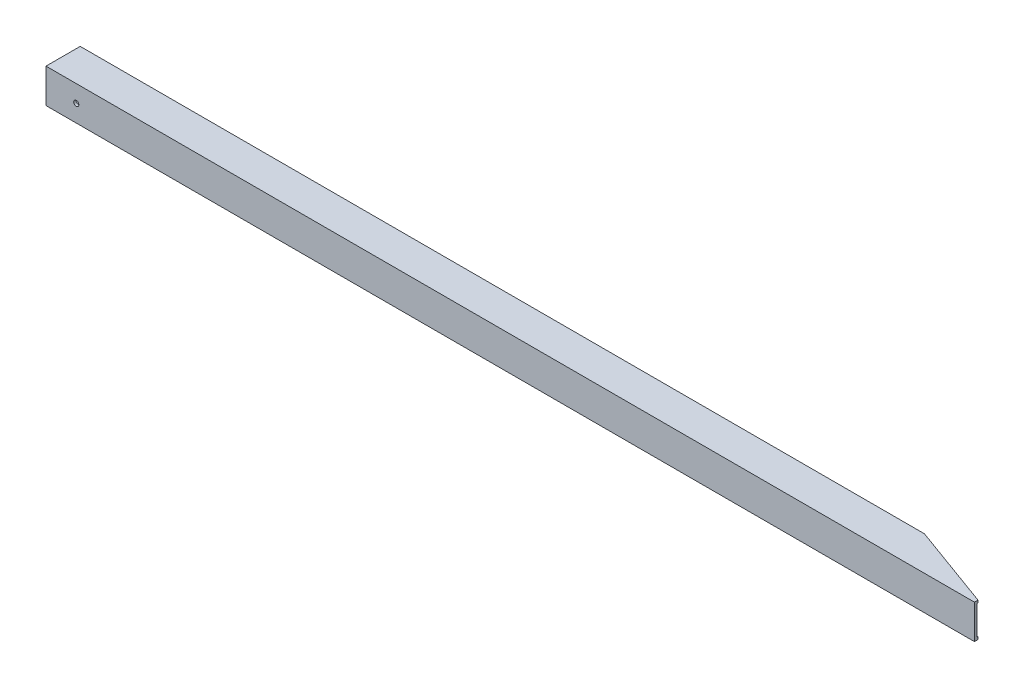
ISO-10303-21;
HEADER;
FILE_DESCRIPTION(('STEP AP214'),'2;1');
FILE_NAME('part.step','',(''),(''),'','','');
FILE_SCHEMA(('AUTOMOTIVE_DESIGN { 1 0 10303 214 1 1 1 1 }'));
ENDSEC;
DATA;
#1=APPLICATION_CONTEXT('core data for automotive mechanical design processes');
#2=APPLICATION_PROTOCOL_DEFINITION('international standard','automotive_design',2000,#1);
#3=PRODUCT_CONTEXT('',#1,'mechanical');
#4=PRODUCT('Part','Part','',(#3));
#5=PRODUCT_RELATED_PRODUCT_CATEGORY('part','',(#4));
#6=PRODUCT_DEFINITION_FORMATION('','',#4);
#7=PRODUCT_DEFINITION_CONTEXT('part definition',#1,'design');
#8=PRODUCT_DEFINITION('design','',#6,#7);
#9=PRODUCT_DEFINITION_SHAPE('','',#8);
#10=(LENGTH_UNIT() NAMED_UNIT(*) SI_UNIT(.MILLI.,.METRE.));
#11=(NAMED_UNIT(*) PLANE_ANGLE_UNIT() SI_UNIT($,.RADIAN.));
#12=(NAMED_UNIT(*) SI_UNIT($,.STERADIAN.) SOLID_ANGLE_UNIT());
#13=UNCERTAINTY_MEASURE_WITH_UNIT(LENGTH_MEASURE(1.E-05),#10,'distance_accuracy_value','');
#14=(GEOMETRIC_REPRESENTATION_CONTEXT(3) GLOBAL_UNCERTAINTY_ASSIGNED_CONTEXT((#13)) GLOBAL_UNIT_ASSIGNED_CONTEXT((#10,
#11,#12)) REPRESENTATION_CONTEXT('',''));
#15=CARTESIAN_POINT('',(0.,0.,0.));
#16=DIRECTION('',(0.,0.,1.));
#17=DIRECTION('',(1.,0.,0.));
#18=AXIS2_PLACEMENT_3D('',#15,#16,#17);
#19=CARTESIAN_POINT('',(0.,0.,0.));
#20=DIRECTION('',(-1.,0.,0.));
#21=DIRECTION('',(0.,0.,1.));
#22=AXIS2_PLACEMENT_3D('',#19,#20,#21);
#23=PLANE('',#22);
#24=DIRECTION('',(0.,-1.,0.));
#25=VECTOR('',#24,1.);
#26=CARTESIAN_POINT('',(0.,0.,0.));
#27=LINE('',#26,#25);
#28=CARTESIAN_POINT('',(0.,44.45,0.));
#29=VERTEX_POINT('',#28);
#30=CARTESIAN_POINT('',(0.,0.,0.));
#31=VERTEX_POINT('',#30);
#32=EDGE_CURVE('E132',#29,#31,#27,.T.);
#33=ORIENTED_EDGE('',*,*,#32,.F.);
#34=DIRECTION('',(0.,0.,1.));
#35=VECTOR('',#34,1.);
#36=CARTESIAN_POINT('',(0.,44.45,0.));
#37=LINE('',#36,#35);
#38=CARTESIAN_POINT('',(0.,44.45,-44.45));
#39=VERTEX_POINT('',#38);
#40=EDGE_CURVE('E140',#39,#29,#37,.T.);
#41=ORIENTED_EDGE('',*,*,#40,.F.);
#42=DIRECTION('',(0.,1.,0.));
#43=VECTOR('',#42,1.);
#44=CARTESIAN_POINT('',(0.,0.,-44.45));
#45=LINE('',#44,#43);
#46=CARTESIAN_POINT('',(0.,0.,-44.45));
#47=VERTEX_POINT('',#46);
#48=EDGE_CURVE('E143',#47,#39,#45,.T.);
#49=ORIENTED_EDGE('',*,*,#48,.F.);
#50=DIRECTION('',(0.,0.,-1.));
#51=VECTOR('',#50,1.);
#52=CARTESIAN_POINT('',(0.,0.,0.));
#53=LINE('',#52,#51);
#54=EDGE_CURVE('E146',#31,#47,#53,.T.);
#55=ORIENTED_EDGE('',*,*,#54,.F.);
#56=EDGE_LOOP('',(#33,#41,#49,#55));
#57=FACE_BOUND('',#56,.T.);
#58=DIRECTION('',(0.,-1.,0.));
#59=VECTOR('',#58,1.);
#60=CARTESIAN_POINT('',(0.,3.17500000000004,-3.175));
#61=LINE('',#60,#59);
#62=CARTESIAN_POINT('',(0.,41.2749999999999,-3.175));
#63=VERTEX_POINT('',#62);
#64=CARTESIAN_POINT('',(0.,3.17500000000004,-3.175));
#65=VERTEX_POINT('',#64);
#66=EDGE_CURVE('E157',#63,#65,#61,.T.);
#67=ORIENTED_EDGE('',*,*,#66,.T.);
#68=DIRECTION('',(0.,0.,-1.));
#69=VECTOR('',#68,1.);
#70=CARTESIAN_POINT('',(0.,3.17500000000004,-3.175));
#71=LINE('',#70,#69);
#72=CARTESIAN_POINT('',(0.,3.17500000000004,-41.275));
#73=VERTEX_POINT('',#72);
#74=EDGE_CURVE('E166',#65,#73,#71,.T.);
#75=ORIENTED_EDGE('',*,*,#74,.T.);
#76=DIRECTION('',(0.,1.,0.));
#77=VECTOR('',#76,1.);
#78=CARTESIAN_POINT('',(0.,3.17500000000004,-41.275));
#79=LINE('',#78,#77);
#80=CARTESIAN_POINT('',(0.,41.2749999999999,-41.275));
#81=VERTEX_POINT('',#80);
#82=EDGE_CURVE('E163',#73,#81,#79,.T.);
#83=ORIENTED_EDGE('',*,*,#82,.T.);
#84=DIRECTION('',(0.,0.,1.));
#85=VECTOR('',#84,1.);
#86=CARTESIAN_POINT('',(0.,41.2749999999999,-3.175));
#87=LINE('',#86,#85);
#88=EDGE_CURVE('E160',#81,#63,#87,.T.);
#89=ORIENTED_EDGE('',*,*,#88,.T.);
#90=EDGE_LOOP('',(#67,#75,#83,#89));
#91=FACE_BOUND('',#90,.T.);
#92=ADVANCED_FACE('F36',(#57,#91),#23,.T.);
#93=CARTESIAN_POINT('',(1219.2,0.,0.));
#94=DIRECTION('',(0.,0.,-1.));
#95=DIRECTION('',(-1.,0.,0.));
#96=AXIS2_PLACEMENT_3D('',#93,#94,#95);
#97=PLANE('',#96);
#98=CARTESIAN_POINT('',(39.37,22.225,0.));
#99=DIRECTION('',(0.,0.,1.));
#100=DIRECTION('',(1.,0.,0.));
#101=AXIS2_PLACEMENT_3D('',#98,#99,#100);
#102=CIRCLE('',#101,3.37819999999999);
#103=CARTESIAN_POINT('',(42.7482,22.225,0.));
#104=VERTEX_POINT('',#103);
#105=EDGE_CURVE('E189',#104,#104,#102,.T.);
#106=ORIENTED_EDGE('',*,*,#105,.F.);
#107=EDGE_LOOP('',(#106));
#108=FACE_BOUND('',#107,.T.);
#109=DIRECTION('',(-1.,0.,0.));
#110=VECTOR('',#109,1.);
#111=CARTESIAN_POINT('',(1219.2,0.,0.));
#112=LINE('',#111,#110);
#113=CARTESIAN_POINT('',(1206.5,0.,0.));
#114=VERTEX_POINT('',#113);
#115=EDGE_CURVE('E44',#114,#31,#112,.T.);
#116=ORIENTED_EDGE('',*,*,#115,.F.);
#117=DIRECTION('',(0.,1.,0.));
#118=VECTOR('',#117,1.);
#119=CARTESIAN_POINT('',(1206.5,0.,0.));
#120=LINE('',#119,#118);
#121=CARTESIAN_POINT('',(1206.5,44.45,0.));
#122=VERTEX_POINT('',#121);
#123=EDGE_CURVE('E112',#114,#122,#120,.T.);
#124=ORIENTED_EDGE('',*,*,#123,.T.);
#125=DIRECTION('',(-1.,0.,0.));
#126=VECTOR('',#125,1.);
#127=CARTESIAN_POINT('',(1219.2,44.45,0.));
#128=LINE('',#127,#126);
#129=EDGE_CURVE('E138',#122,#29,#128,.T.);
#130=ORIENTED_EDGE('',*,*,#129,.T.);
#131=ORIENTED_EDGE('',*,*,#32,.T.);
#132=EDGE_LOOP('',(#116,#124,#130,#131));
#133=FACE_BOUND('',#132,.T.);
#134=ADVANCED_FACE('F38',(#108,#133),#97,.F.);
#135=CARTESIAN_POINT('',(1219.2,0.,0.));
#136=DIRECTION('',(0.,1.,0.));
#137=DIRECTION('',(0.,0.,1.));
#138=AXIS2_PLACEMENT_3D('',#135,#136,#137);
#139=PLANE('',#138);
#140=DIRECTION('',(0.939692620785908,0.,0.342020143325669));
#141=VECTOR('',#140,1.);
#142=CARTESIAN_POINT('',(1219.2,0.,0.));
#143=LINE('',#142,#141);
#144=CARTESIAN_POINT('',(1097.07462870524,0.,-44.45));
#145=VERTEX_POINT('',#144);
#146=CARTESIAN_POINT('',(1206.5,0.,-4.62242197518075));
#147=VERTEX_POINT('',#146);
#148=EDGE_CURVE('E128',#145,#147,#143,.T.);
#149=ORIENTED_EDGE('',*,*,#148,.T.);
#150=DIRECTION('',(0.,0.,1.));
#151=VECTOR('',#150,1.);
#152=CARTESIAN_POINT('',(1206.5,0.,0.));
#153=LINE('',#152,#151);
#154=EDGE_CURVE('E51',#147,#114,#153,.T.);
#155=ORIENTED_EDGE('',*,*,#154,.T.);
#156=ORIENTED_EDGE('',*,*,#115,.T.);
#157=ORIENTED_EDGE('',*,*,#54,.T.);
#158=DIRECTION('',(-1.,0.,0.));
#159=VECTOR('',#158,1.);
#160=CARTESIAN_POINT('',(1219.2,0.,-44.45));
#161=LINE('',#160,#159);
#162=EDGE_CURVE('E133',#145,#47,#161,.T.);
#163=ORIENTED_EDGE('',*,*,#162,.F.);
#164=EDGE_LOOP('',(#149,#155,#156,#157,#163));
#165=FACE_BOUND('',#164,.T.);
#166=ADVANCED_FACE('F124',(#165),#139,.F.);
#167=CARTESIAN_POINT('',(1219.2,0.,-44.45));
#168=DIRECTION('',(0.,0.,1.));
#169=DIRECTION('',(1.,0.,0.));
#170=AXIS2_PLACEMENT_3D('',#167,#168,#169);
#171=PLANE('',#170);
#172=CARTESIAN_POINT('',(39.37,22.225,-44.45));
#173=DIRECTION('',(0.,0.,1.));
#174=DIRECTION('',(1.,0.,0.));
#175=AXIS2_PLACEMENT_3D('',#172,#173,#174);
#176=CIRCLE('',#175,3.37819999999998);
#177=CARTESIAN_POINT('',(42.7482,22.225,-44.45));
#178=VERTEX_POINT('',#177);
#179=EDGE_CURVE('E186',#178,#178,#176,.T.);
#180=ORIENTED_EDGE('',*,*,#179,.T.);
#181=EDGE_LOOP('',(#180));
#182=FACE_BOUND('',#181,.T.);
#183=DIRECTION('',(-1.,0.,0.));
#184=VECTOR('',#183,1.);
#185=CARTESIAN_POINT('',(1219.2,44.45,-44.45));
#186=LINE('',#185,#184);
#187=CARTESIAN_POINT('',(1097.07462870524,44.45,-44.45));
#188=VERTEX_POINT('',#187);
#189=EDGE_CURVE('E134',#188,#39,#186,.T.);
#190=ORIENTED_EDGE('',*,*,#189,.F.);
#191=DIRECTION('',(0.,1.,0.));
#192=VECTOR('',#191,1.);
#193=CARTESIAN_POINT('',(1097.07462870524,0.,-44.45));
#194=LINE('',#193,#192);
#195=EDGE_CURVE('E59',#145,#188,#194,.T.);
#196=ORIENTED_EDGE('',*,*,#195,.F.);
#197=ORIENTED_EDGE('',*,*,#162,.T.);
#198=ORIENTED_EDGE('',*,*,#48,.T.);
#199=EDGE_LOOP('',(#190,#196,#197,#198));
#200=FACE_BOUND('',#199,.T.);
#201=ADVANCED_FACE('F227',(#182,#200),#171,.F.);
#202=CARTESIAN_POINT('',(1219.2,44.45,0.));
#203=DIRECTION('',(0.,-1.,0.));
#204=DIRECTION('',(0.,0.,-1.));
#205=AXIS2_PLACEMENT_3D('',#202,#203,#204);
#206=PLANE('',#205);
#207=ORIENTED_EDGE('',*,*,#129,.F.);
#208=DIRECTION('',(0.,0.,1.));
#209=VECTOR('',#208,1.);
#210=CARTESIAN_POINT('',(1206.5,44.45,0.));
#211=LINE('',#210,#209);
#212=CARTESIAN_POINT('',(1206.5,44.45,-4.62242197518076));
#213=VERTEX_POINT('',#212);
#214=EDGE_CURVE('E115',#213,#122,#211,.T.);
#215=ORIENTED_EDGE('',*,*,#214,.F.);
#216=DIRECTION('',(0.939692620785908,0.,0.342020143325669));
#217=VECTOR('',#216,1.);
#218=CARTESIAN_POINT('',(1219.2,44.45,0.));
#219=LINE('',#218,#217);
#220=EDGE_CURVE('E177',#188,#213,#219,.T.);
#221=ORIENTED_EDGE('',*,*,#220,.F.);
#222=ORIENTED_EDGE('',*,*,#189,.T.);
#223=ORIENTED_EDGE('',*,*,#40,.T.);
#224=EDGE_LOOP('',(#207,#215,#221,#222,#223));
#225=FACE_BOUND('',#224,.T.);
#226=ADVANCED_FACE('F225',(#225),#206,.F.);
#227=CARTESIAN_POINT('',(1219.2,3.17500000000004,-3.175));
#228=DIRECTION('',(0.,1.,0.));
#229=DIRECTION('',(0.,0.,1.));
#230=AXIS2_PLACEMENT_3D('',#227,#228,#229);
#231=PLANE('',#230);
#232=DIRECTION('',(0.,0.,1.));
#233=VECTOR('',#232,1.);
#234=CARTESIAN_POINT('',(1206.5,3.17500000000004,-3.175));
#235=LINE('',#234,#233);
#236=CARTESIAN_POINT('',(1206.5,3.17500000000004,-4.62242197518076));
#237=VERTEX_POINT('',#236);
#238=CARTESIAN_POINT('',(1206.5,3.17500000000004,-3.175));
#239=VERTEX_POINT('',#238);
#240=EDGE_CURVE('E192',#237,#239,#235,.T.);
#241=ORIENTED_EDGE('',*,*,#240,.F.);
#242=DIRECTION('',(0.939692620785908,0.,0.342020143325669));
#243=VECTOR('',#242,1.);
#244=CARTESIAN_POINT('',(1218.17957466962,3.17500000000004,-0.371404446548624));
#245=LINE('',#244,#243);
#246=CARTESIAN_POINT('',(1105.79786951201,3.17500000000004,-41.275));
#247=VERTEX_POINT('',#246);
#248=EDGE_CURVE('E169',#247,#237,#245,.T.);
#249=ORIENTED_EDGE('',*,*,#248,.F.);
#250=DIRECTION('',(-1.,0.,0.));
#251=VECTOR('',#250,1.);
#252=CARTESIAN_POINT('',(1219.2,3.17500000000004,-41.275));
#253=LINE('',#252,#251);
#254=EDGE_CURVE('E149',#247,#73,#253,.T.);
#255=ORIENTED_EDGE('',*,*,#254,.T.);
#256=ORIENTED_EDGE('',*,*,#74,.F.);
#257=DIRECTION('',(-1.,0.,0.));
#258=VECTOR('',#257,1.);
#259=CARTESIAN_POINT('',(1219.2,3.17500000000004,-3.175));
#260=LINE('',#259,#258);
#261=EDGE_CURVE('E155',#239,#65,#260,.T.);
#262=ORIENTED_EDGE('',*,*,#261,.F.);
#263=EDGE_LOOP('',(#241,#249,#255,#256,#262));
#264=FACE_BOUND('',#263,.T.);
#265=ADVANCED_FACE('F203',(#264),#231,.T.);
#266=CARTESIAN_POINT('',(1219.2,3.17500000000004,-41.275));
#267=DIRECTION('',(0.,0.,1.));
#268=DIRECTION('',(1.,0.,0.));
#269=AXIS2_PLACEMENT_3D('',#266,#267,#268);
#270=PLANE('',#269);
#271=CARTESIAN_POINT('',(39.37,22.225,-41.275));
#272=DIRECTION('',(0.,0.,1.));
#273=DIRECTION('',(1.,0.,0.));
#274=AXIS2_PLACEMENT_3D('',#271,#272,#273);
#275=CIRCLE('',#274,3.37819999999999);
#276=CARTESIAN_POINT('',(42.7482,22.225,-41.275));
#277=VERTEX_POINT('',#276);
#278=EDGE_CURVE('E179',#277,#277,#275,.T.);
#279=ORIENTED_EDGE('',*,*,#278,.F.);
#280=EDGE_LOOP('',(#279));
#281=FACE_BOUND('',#280,.T.);
#282=DIRECTION('',(0.,-1.,0.));
#283=VECTOR('',#282,1.);
#284=CARTESIAN_POINT('',(1105.79786951201,3.17500000000004,-41.275));
#285=LINE('',#284,#283);
#286=CARTESIAN_POINT('',(1105.79786951201,41.2749999999999,-41.275));
#287=VERTEX_POINT('',#286);
#288=EDGE_CURVE('E172',#287,#247,#285,.T.);
#289=ORIENTED_EDGE('',*,*,#288,.F.);
#290=DIRECTION('',(-1.,0.,0.));
#291=VECTOR('',#290,1.);
#292=CARTESIAN_POINT('',(1219.2,41.2749999999999,-41.275));
#293=LINE('',#292,#291);
#294=EDGE_CURVE('E151',#287,#81,#293,.T.);
#295=ORIENTED_EDGE('',*,*,#294,.T.);
#296=ORIENTED_EDGE('',*,*,#82,.F.);
#297=ORIENTED_EDGE('',*,*,#254,.F.);
#298=EDGE_LOOP('',(#289,#295,#296,#297));
#299=FACE_BOUND('',#298,.T.);
#300=ADVANCED_FACE('F211',(#281,#299),#270,.T.);
#301=CARTESIAN_POINT('',(1219.2,41.2749999999999,-3.175));
#302=DIRECTION('',(0.,-1.,0.));
#303=DIRECTION('',(0.,0.,-1.));
#304=AXIS2_PLACEMENT_3D('',#301,#302,#303);
#305=PLANE('',#304);
#306=DIRECTION('',(0.,0.,-1.));
#307=VECTOR('',#306,1.);
#308=CARTESIAN_POINT('',(1206.5,41.2749999999999,-3.175));
#309=LINE('',#308,#307);
#310=CARTESIAN_POINT('',(1206.5,41.2749999999999,-3.175));
#311=VERTEX_POINT('',#310);
#312=CARTESIAN_POINT('',(1206.5,41.2749999999999,-4.62242197518076));
#313=VERTEX_POINT('',#312);
#314=EDGE_CURVE('E194',#311,#313,#309,.T.);
#315=ORIENTED_EDGE('',*,*,#314,.F.);
#316=DIRECTION('',(-1.,0.,0.));
#317=VECTOR('',#316,1.);
#318=CARTESIAN_POINT('',(1219.2,41.2749999999999,-3.175));
#319=LINE('',#318,#317);
#320=EDGE_CURVE('E153',#311,#63,#319,.T.);
#321=ORIENTED_EDGE('',*,*,#320,.T.);
#322=ORIENTED_EDGE('',*,*,#88,.F.);
#323=ORIENTED_EDGE('',*,*,#294,.F.);
#324=DIRECTION('',(-0.939692620785908,0.,-0.342020143325669));
#325=VECTOR('',#324,1.);
#326=CARTESIAN_POINT('',(1218.17957466962,41.2749999999999,-0.371404446548624));
#327=LINE('',#326,#325);
#328=EDGE_CURVE('E174',#313,#287,#327,.T.);
#329=ORIENTED_EDGE('',*,*,#328,.F.);
#330=EDGE_LOOP('',(#315,#321,#322,#323,#329));
#331=FACE_BOUND('',#330,.T.);
#332=ADVANCED_FACE('F216',(#331),#305,.T.);
#333=CARTESIAN_POINT('',(1219.2,3.17500000000004,-3.175));
#334=DIRECTION('',(0.,0.,-1.));
#335=DIRECTION('',(-1.,0.,0.));
#336=AXIS2_PLACEMENT_3D('',#333,#334,#335);
#337=PLANE('',#336);
#338=DIRECTION('',(0.,1.,0.));
#339=VECTOR('',#338,1.);
#340=CARTESIAN_POINT('',(1206.5,3.17500000000004,-3.175));
#341=LINE('',#340,#339);
#342=EDGE_CURVE('E119',#239,#311,#341,.T.);
#343=ORIENTED_EDGE('',*,*,#342,.F.);
#344=ORIENTED_EDGE('',*,*,#261,.T.);
#345=ORIENTED_EDGE('',*,*,#66,.F.);
#346=ORIENTED_EDGE('',*,*,#320,.F.);
#347=EDGE_LOOP('',(#343,#344,#345,#346));
#348=FACE_BOUND('',#347,.T.);
#349=CARTESIAN_POINT('',(39.37,22.225,-3.175));
#350=DIRECTION('',(0.,0.,-1.));
#351=DIRECTION('',(-1.,0.,0.));
#352=AXIS2_PLACEMENT_3D('',#349,#350,#351);
#353=CIRCLE('',#352,3.37819999999999);
#354=CARTESIAN_POINT('',(35.9918,22.225,-3.175));
#355=VERTEX_POINT('',#354);
#356=EDGE_CURVE('E183',#355,#355,#353,.T.);
#357=ORIENTED_EDGE('',*,*,#356,.F.);
#358=EDGE_LOOP('',(#357));
#359=FACE_BOUND('',#358,.T.);
#360=ADVANCED_FACE('F221',(#348,#359),#337,.T.);
#361=CARTESIAN_POINT('',(1219.2,0.,0.));
#362=DIRECTION('',(-0.342020143325669,0.,0.939692620785908));
#363=DIRECTION('',(0.939692620785908,0.,0.342020143325669));
#364=AXIS2_PLACEMENT_3D('',#361,#362,#363);
#365=PLANE('',#364);
#366=ORIENTED_EDGE('',*,*,#220,.T.);
#367=DIRECTION('',(0.,-1.,0.));
#368=VECTOR('',#367,1.);
#369=CARTESIAN_POINT('',(1206.5,0.,-4.62242197518076));
#370=LINE('',#369,#368);
#371=EDGE_CURVE('E11',#213,#313,#370,.T.);
#372=ORIENTED_EDGE('',*,*,#371,.T.);
#373=ORIENTED_EDGE('',*,*,#328,.T.);
#374=ORIENTED_EDGE('',*,*,#288,.T.);
#375=ORIENTED_EDGE('',*,*,#248,.T.);
#376=DIRECTION('',(0.,1.,0.));
#377=VECTOR('',#376,1.);
#378=CARTESIAN_POINT('',(1206.5,0.,-4.62242197518076));
#379=LINE('',#378,#377);
#380=EDGE_CURVE('E120',#147,#237,#379,.T.);
#381=ORIENTED_EDGE('',*,*,#380,.F.);
#382=ORIENTED_EDGE('',*,*,#148,.F.);
#383=ORIENTED_EDGE('',*,*,#195,.T.);
#384=EDGE_LOOP('',(#366,#372,#373,#374,#375,#381,#382,#383));
#385=FACE_BOUND('',#384,.T.);
#386=ADVANCED_FACE('F206',(#385),#365,.F.);
#387=CARTESIAN_POINT('',(39.37,22.225,0.));
#388=DIRECTION('',(0.,0.,1.));
#389=DIRECTION('',(1.,0.,0.));
#390=AXIS2_PLACEMENT_3D('',#387,#388,#389);
#391=CYLINDRICAL_SURFACE('',#390,3.37819999999999);
#392=ORIENTED_EDGE('',*,*,#356,.T.);
#393=EDGE_LOOP('',(#392));
#394=FACE_BOUND('',#393,.T.);
#395=ORIENTED_EDGE('',*,*,#105,.T.);
#396=EDGE_LOOP('',(#395));
#397=FACE_BOUND('',#396,.T.);
#398=ADVANCED_FACE('F287',(#394,#397),#391,.F.);
#399=ORIENTED_EDGE('',*,*,#278,.T.);
#400=EDGE_LOOP('',(#399));
#401=FACE_BOUND('',#400,.T.);
#402=ORIENTED_EDGE('',*,*,#179,.F.);
#403=EDGE_LOOP('',(#402));
#404=FACE_BOUND('',#403,.T.);
#405=ADVANCED_FACE('F294',(#401,#404),#391,.F.);
#406=CARTESIAN_POINT('',(1206.5,0.,0.));
#407=DIRECTION('',(-1.,0.,0.));
#408=DIRECTION('',(0.,0.,1.));
#409=AXIS2_PLACEMENT_3D('',#406,#407,#408);
#410=PLANE('',#409);
#411=ORIENTED_EDGE('',*,*,#240,.T.);
#412=ORIENTED_EDGE('',*,*,#342,.T.);
#413=ORIENTED_EDGE('',*,*,#314,.T.);
#414=ORIENTED_EDGE('',*,*,#371,.F.);
#415=ORIENTED_EDGE('',*,*,#214,.T.);
#416=ORIENTED_EDGE('',*,*,#123,.F.);
#417=ORIENTED_EDGE('',*,*,#154,.F.);
#418=ORIENTED_EDGE('',*,*,#380,.T.);
#419=EDGE_LOOP('',(#411,#412,#413,#414,#415,#416,#417,#418));
#420=FACE_BOUND('',#419,.T.);
#421=ADVANCED_FACE('F113',(#420),#410,.F.);
#422=CLOSED_SHELL('',(#92,#134,#166,#201,#226,#265,#300,#332,#360,#386,#398,#405,#421));
#423=MANIFOLD_SOLID_BREP('B2',#422);
#424=ADVANCED_BREP_SHAPE_REPRESENTATION('',(#18,#423),#14);
#425=SHAPE_DEFINITION_REPRESENTATION(#9,#424);
ENDSEC;
END-ISO-10303-21;
